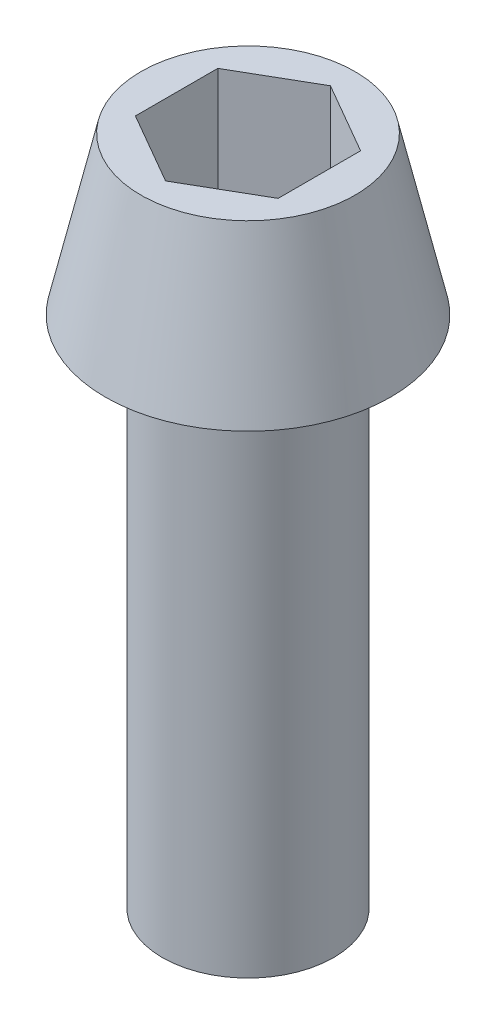
ISO-10303-21;
HEADER;
FILE_DESCRIPTION(('STEP AP214'),'2;1');
FILE_NAME('part.step','',(''),(''),'','','');
FILE_SCHEMA(('AUTOMOTIVE_DESIGN { 1 0 10303 214 1 1 1 1 }'));
ENDSEC;
DATA;
#1=APPLICATION_CONTEXT('core data for automotive mechanical design processes');
#2=APPLICATION_PROTOCOL_DEFINITION('international standard','automotive_design',2000,#1);
#3=PRODUCT_CONTEXT('',#1,'mechanical');
#4=PRODUCT('Part','Part','',(#3));
#5=PRODUCT_RELATED_PRODUCT_CATEGORY('part','',(#4));
#6=PRODUCT_DEFINITION_FORMATION('','',#4);
#7=PRODUCT_DEFINITION_CONTEXT('part definition',#1,'design');
#8=PRODUCT_DEFINITION('design','',#6,#7);
#9=PRODUCT_DEFINITION_SHAPE('','',#8);
#10=(LENGTH_UNIT() NAMED_UNIT(*) SI_UNIT(.MILLI.,.METRE.));
#11=(NAMED_UNIT(*) PLANE_ANGLE_UNIT() SI_UNIT($,.RADIAN.));
#12=(NAMED_UNIT(*) SI_UNIT($,.STERADIAN.) SOLID_ANGLE_UNIT());
#13=UNCERTAINTY_MEASURE_WITH_UNIT(LENGTH_MEASURE(1.E-05),#10,'distance_accuracy_value','');
#14=(GEOMETRIC_REPRESENTATION_CONTEXT(3) GLOBAL_UNCERTAINTY_ASSIGNED_CONTEXT((#13)) GLOBAL_UNIT_ASSIGNED_CONTEXT((#10,
#11,#12)) REPRESENTATION_CONTEXT('',''));
#15=CARTESIAN_POINT('',(0.,0.,0.));
#16=DIRECTION('',(0.,0.,1.));
#17=DIRECTION('',(1.,0.,0.));
#18=AXIS2_PLACEMENT_3D('',#15,#16,#17);
#19=CARTESIAN_POINT('',(0.,5.5,0.));
#20=DIRECTION('',(0.,1.,0.));
#21=DIRECTION('',(-1.,0.,0.));
#22=AXIS2_PLACEMENT_3D('',#19,#20,#21);
#23=PLANE('',#22);
#24=DIRECTION('',(-0.866025403784439,0.,-0.5));
#25=VECTOR('',#24,1.);
#26=CARTESIAN_POINT('',(2.5,5.5,-1.44337567297406));
#27=LINE('',#26,#25);
#28=CARTESIAN_POINT('',(2.5,5.5,-1.44337567297406));
#29=VERTEX_POINT('',#28);
#30=CARTESIAN_POINT('',(0.,5.5,-2.88675134594813));
#31=VERTEX_POINT('',#30);
#32=EDGE_CURVE('E41',#29,#31,#27,.T.);
#33=ORIENTED_EDGE('',*,*,#32,.F.);
#34=DIRECTION('',(0.,0.,-1.));
#35=VECTOR('',#34,1.);
#36=CARTESIAN_POINT('',(2.5,5.5,1.44337567297407));
#37=LINE('',#36,#35);
#38=CARTESIAN_POINT('',(2.5,5.5,1.44337567297407));
#39=VERTEX_POINT('',#38);
#40=EDGE_CURVE('E110',#39,#29,#37,.T.);
#41=ORIENTED_EDGE('',*,*,#40,.F.);
#42=DIRECTION('',(0.866025403784439,0.,-0.5));
#43=VECTOR('',#42,1.);
#44=CARTESIAN_POINT('',(0.,5.5,2.88675134594813));
#45=LINE('',#44,#43);
#46=CARTESIAN_POINT('',(0.,5.5,2.88675134594813));
#47=VERTEX_POINT('',#46);
#48=EDGE_CURVE('E104',#47,#39,#45,.T.);
#49=ORIENTED_EDGE('',*,*,#48,.F.);
#50=DIRECTION('',(0.866025403784439,0.,0.5));
#51=VECTOR('',#50,1.);
#52=CARTESIAN_POINT('',(-2.5,5.5,1.44337567297406));
#53=LINE('',#52,#51);
#54=CARTESIAN_POINT('',(-2.5,5.5,1.44337567297406));
#55=VERTEX_POINT('',#54);
#56=EDGE_CURVE('E102',#55,#47,#53,.T.);
#57=ORIENTED_EDGE('',*,*,#56,.F.);
#58=DIRECTION('',(0.,0.,1.));
#59=VECTOR('',#58,1.);
#60=CARTESIAN_POINT('',(-2.5,5.5,-1.44337567297407));
#61=LINE('',#60,#59);
#62=CARTESIAN_POINT('',(-2.5,5.5,-1.44337567297407));
#63=VERTEX_POINT('',#62);
#64=EDGE_CURVE('E84',#63,#55,#61,.T.);
#65=ORIENTED_EDGE('',*,*,#64,.F.);
#66=DIRECTION('',(-0.866025403784439,0.,0.5));
#67=VECTOR('',#66,1.);
#68=CARTESIAN_POINT('',(0.,5.5,-2.88675134594813));
#69=LINE('',#68,#67);
#70=EDGE_CURVE('E95',#31,#63,#69,.T.);
#71=ORIENTED_EDGE('',*,*,#70,.F.);
#72=EDGE_LOOP('',(#33,#41,#49,#57,#65,#71));
#73=FACE_BOUND('',#72,.T.);
#74=CARTESIAN_POINT('',(0.,5.5,0.));
#75=DIRECTION('',(0.,1.,0.));
#76=DIRECTION('',(-1.,0.,0.));
#77=AXIS2_PLACEMENT_3D('',#74,#75,#76);
#78=CIRCLE('',#77,3.74999999999999);
#79=CARTESIAN_POINT('',(-3.74999999999999,5.5,0.));
#80=VERTEX_POINT('',#79);
#81=EDGE_CURVE('E128',#80,#80,#78,.T.);
#82=ORIENTED_EDGE('',*,*,#81,.T.);
#83=EDGE_LOOP('',(#82));
#84=FACE_BOUND('',#83,.T.);
#85=ADVANCED_FACE('F27',(#73,#84),#23,.T.);
#86=CARTESIAN_POINT('',(-3.,-18.,0.));
#87=DIRECTION('',(0.,-1.,0.));
#88=DIRECTION('',(1.,0.,0.));
#89=AXIS2_PLACEMENT_3D('',#86,#87,#88);
#90=PLANE('',#89);
#91=CARTESIAN_POINT('',(0.,-18.,0.));
#92=DIRECTION('',(0.,1.,0.));
#93=DIRECTION('',(-1.,0.,0.));
#94=AXIS2_PLACEMENT_3D('',#91,#92,#93);
#95=CIRCLE('',#94,3.);
#96=CARTESIAN_POINT('',(-3.,-18.,0.));
#97=VERTEX_POINT('',#96);
#98=EDGE_CURVE('E11',#97,#97,#95,.T.);
#99=ORIENTED_EDGE('',*,*,#98,.F.);
#100=EDGE_LOOP('',(#99));
#101=FACE_BOUND('',#100,.T.);
#102=ADVANCED_FACE('F147',(#101),#90,.T.);
#103=CARTESIAN_POINT('',(0.,21.1330687830688,0.));
#104=DIRECTION('',(0.,1.,0.));
#105=DIRECTION('',(-1.,0.,0.));
#106=AXIS2_PLACEMENT_3D('',#103,#104,#105);
#107=CYLINDRICAL_SURFACE('',#106,3.);
#108=ORIENTED_EDGE('',*,*,#98,.T.);
#109=EDGE_LOOP('',(#108));
#110=FACE_BOUND('',#109,.T.);
#111=CARTESIAN_POINT('',(0.,0.,0.));
#112=DIRECTION('',(0.,1.,0.));
#113=DIRECTION('',(-1.,0.,0.));
#114=AXIS2_PLACEMENT_3D('',#111,#112,#113);
#115=CIRCLE('',#114,2.99999999999999);
#116=CARTESIAN_POINT('',(-2.99999999999999,0.,0.));
#117=VERTEX_POINT('',#116);
#118=EDGE_CURVE('E34',#117,#117,#115,.T.);
#119=ORIENTED_EDGE('',*,*,#118,.F.);
#120=EDGE_LOOP('',(#119));
#121=FACE_BOUND('',#120,.T.);
#122=ADVANCED_FACE('F145',(#110,#121),#107,.T.);
#123=CARTESIAN_POINT('',(-4.99999999999999,0.,0.));
#124=DIRECTION('',(0.,-1.,0.));
#125=DIRECTION('',(1.,0.,0.));
#126=AXIS2_PLACEMENT_3D('',#123,#124,#125);
#127=PLANE('',#126);
#128=ORIENTED_EDGE('',*,*,#118,.T.);
#129=EDGE_LOOP('',(#128));
#130=FACE_BOUND('',#129,.T.);
#131=CARTESIAN_POINT('',(0.,0.,0.));
#132=DIRECTION('',(0.,1.,0.));
#133=DIRECTION('',(-1.,0.,0.));
#134=AXIS2_PLACEMENT_3D('',#131,#132,#133);
#135=CIRCLE('',#134,4.99999999999999);
#136=CARTESIAN_POINT('',(-4.99999999999999,0.,0.));
#137=VERTEX_POINT('',#136);
#138=EDGE_CURVE('E137',#137,#137,#135,.T.);
#139=ORIENTED_EDGE('',*,*,#138,.F.);
#140=EDGE_LOOP('',(#139));
#141=FACE_BOUND('',#140,.T.);
#142=ADVANCED_FACE('F142',(#130,#141),#127,.T.);
#143=CARTESIAN_POINT('',(0.,5.5,0.));
#144=DIRECTION('',(0.,-1.,0.));
#145=DIRECTION('',(1.,0.,0.));
#146=AXIS2_PLACEMENT_3D('',#143,#144,#145);
#147=CONICAL_SURFACE('',#146,3.74999999999999,0.223476601140633);
#148=ORIENTED_EDGE('',*,*,#138,.T.);
#149=EDGE_LOOP('',(#148));
#150=FACE_BOUND('',#149,.T.);
#151=ORIENTED_EDGE('',*,*,#81,.F.);
#152=EDGE_LOOP('',(#151));
#153=FACE_BOUND('',#152,.T.);
#154=ADVANCED_FACE('F154',(#150,#153),#147,.T.);
#155=CARTESIAN_POINT('',(2.5,1.5,-1.44337567297406));
#156=DIRECTION('',(0.5,0.,-0.866025403784439));
#157=DIRECTION('',(-0.866025403784439,0.,-0.5));
#158=AXIS2_PLACEMENT_3D('',#155,#156,#157);
#159=PLANE('',#158);
#160=ORIENTED_EDGE('',*,*,#32,.T.);
#161=DIRECTION('',(0.,1.,0.));
#162=VECTOR('',#161,1.);
#163=CARTESIAN_POINT('',(0.,1.5,-2.88675134594813));
#164=LINE('',#163,#162);
#165=CARTESIAN_POINT('',(0.,1.5,-2.88675134594813));
#166=VERTEX_POINT('',#165);
#167=EDGE_CURVE('E92',#166,#31,#164,.T.);
#168=ORIENTED_EDGE('',*,*,#167,.F.);
#169=DIRECTION('',(-0.866025403784439,0.,-0.5));
#170=VECTOR('',#169,1.);
#171=CARTESIAN_POINT('',(2.5,1.5,-1.44337567297406));
#172=LINE('',#171,#170);
#173=CARTESIAN_POINT('',(2.5,1.5,-1.44337567297406));
#174=VERTEX_POINT('',#173);
#175=EDGE_CURVE('E112',#174,#166,#172,.T.);
#176=ORIENTED_EDGE('',*,*,#175,.F.);
#177=DIRECTION('',(0.,1.,0.));
#178=VECTOR('',#177,1.);
#179=CARTESIAN_POINT('',(2.5,1.5,-1.44337567297406));
#180=LINE('',#179,#178);
#181=EDGE_CURVE('E48',#174,#29,#180,.T.);
#182=ORIENTED_EDGE('',*,*,#181,.T.);
#183=EDGE_LOOP('',(#160,#168,#176,#182));
#184=FACE_BOUND('',#183,.T.);
#185=ADVANCED_FACE('F167',(#184),#159,.F.);
#186=CARTESIAN_POINT('',(2.5,1.5,1.44337567297407));
#187=DIRECTION('',(1.,0.,0.));
#188=DIRECTION('',(0.,0.,-1.));
#189=AXIS2_PLACEMENT_3D('',#186,#187,#188);
#190=PLANE('',#189);
#191=ORIENTED_EDGE('',*,*,#40,.T.);
#192=ORIENTED_EDGE('',*,*,#181,.F.);
#193=DIRECTION('',(0.,0.,-1.));
#194=VECTOR('',#193,1.);
#195=CARTESIAN_POINT('',(2.5,1.5,1.44337567297407));
#196=LINE('',#195,#194);
#197=CARTESIAN_POINT('',(2.5,1.5,1.44337567297407));
#198=VERTEX_POINT('',#197);
#199=EDGE_CURVE('E124',#198,#174,#196,.T.);
#200=ORIENTED_EDGE('',*,*,#199,.F.);
#201=DIRECTION('',(0.,1.,0.));
#202=VECTOR('',#201,1.);
#203=CARTESIAN_POINT('',(2.5,1.5,1.44337567297407));
#204=LINE('',#203,#202);
#205=EDGE_CURVE('E129',#198,#39,#204,.T.);
#206=ORIENTED_EDGE('',*,*,#205,.T.);
#207=EDGE_LOOP('',(#191,#192,#200,#206));
#208=FACE_BOUND('',#207,.T.);
#209=ADVANCED_FACE('F171',(#208),#190,.F.);
#210=CARTESIAN_POINT('',(0.,1.5,2.88675134594813));
#211=DIRECTION('',(0.5,0.,0.866025403784439));
#212=DIRECTION('',(0.866025403784439,0.,-0.5));
#213=AXIS2_PLACEMENT_3D('',#210,#211,#212);
#214=PLANE('',#213);
#215=ORIENTED_EDGE('',*,*,#48,.T.);
#216=ORIENTED_EDGE('',*,*,#205,.F.);
#217=DIRECTION('',(0.866025403784439,0.,-0.5));
#218=VECTOR('',#217,1.);
#219=CARTESIAN_POINT('',(0.,1.5,2.88675134594813));
#220=LINE('',#219,#218);
#221=CARTESIAN_POINT('',(0.,1.5,2.88675134594813));
#222=VERTEX_POINT('',#221);
#223=EDGE_CURVE('E121',#222,#198,#220,.T.);
#224=ORIENTED_EDGE('',*,*,#223,.F.);
#225=DIRECTION('',(0.,1.,0.));
#226=VECTOR('',#225,1.);
#227=CARTESIAN_POINT('',(0.,1.5,2.88675134594813));
#228=LINE('',#227,#226);
#229=EDGE_CURVE('E131',#222,#47,#228,.T.);
#230=ORIENTED_EDGE('',*,*,#229,.T.);
#231=EDGE_LOOP('',(#215,#216,#224,#230));
#232=FACE_BOUND('',#231,.T.);
#233=ADVANCED_FACE('F178',(#232),#214,.F.);
#234=CARTESIAN_POINT('',(-2.5,1.5,1.44337567297406));
#235=DIRECTION('',(-0.5,0.,0.866025403784439));
#236=DIRECTION('',(0.866025403784439,0.,0.5));
#237=AXIS2_PLACEMENT_3D('',#234,#235,#236);
#238=PLANE('',#237);
#239=ORIENTED_EDGE('',*,*,#56,.T.);
#240=ORIENTED_EDGE('',*,*,#229,.F.);
#241=DIRECTION('',(0.866025403784439,0.,0.5));
#242=VECTOR('',#241,1.);
#243=CARTESIAN_POINT('',(-2.5,1.5,1.44337567297406));
#244=LINE('',#243,#242);
#245=CARTESIAN_POINT('',(-2.5,1.5,1.44337567297406));
#246=VERTEX_POINT('',#245);
#247=EDGE_CURVE('E118',#246,#222,#244,.T.);
#248=ORIENTED_EDGE('',*,*,#247,.F.);
#249=DIRECTION('',(0.,1.,0.));
#250=VECTOR('',#249,1.);
#251=CARTESIAN_POINT('',(-2.5,1.5,1.44337567297406));
#252=LINE('',#251,#250);
#253=EDGE_CURVE('E91',#246,#55,#252,.T.);
#254=ORIENTED_EDGE('',*,*,#253,.T.);
#255=EDGE_LOOP('',(#239,#240,#248,#254));
#256=FACE_BOUND('',#255,.T.);
#257=ADVANCED_FACE('F185',(#256),#238,.F.);
#258=CARTESIAN_POINT('',(-2.5,1.5,-1.44337567297407));
#259=DIRECTION('',(-1.,0.,0.));
#260=DIRECTION('',(0.,0.,1.));
#261=AXIS2_PLACEMENT_3D('',#258,#259,#260);
#262=PLANE('',#261);
#263=ORIENTED_EDGE('',*,*,#64,.T.);
#264=ORIENTED_EDGE('',*,*,#253,.F.);
#265=DIRECTION('',(0.,0.,1.));
#266=VECTOR('',#265,1.);
#267=CARTESIAN_POINT('',(-2.5,1.5,-1.44337567297407));
#268=LINE('',#267,#266);
#269=CARTESIAN_POINT('',(-2.5,1.5,-1.44337567297407));
#270=VERTEX_POINT('',#269);
#271=EDGE_CURVE('E87',#270,#246,#268,.T.);
#272=ORIENTED_EDGE('',*,*,#271,.F.);
#273=DIRECTION('',(0.,1.,0.));
#274=VECTOR('',#273,1.);
#275=CARTESIAN_POINT('',(-2.5,1.5,-1.44337567297407));
#276=LINE('',#275,#274);
#277=EDGE_CURVE('E80',#270,#63,#276,.T.);
#278=ORIENTED_EDGE('',*,*,#277,.T.);
#279=EDGE_LOOP('',(#263,#264,#272,#278));
#280=FACE_BOUND('',#279,.T.);
#281=ADVANCED_FACE('F82',(#280),#262,.F.);
#282=CARTESIAN_POINT('',(0.,1.5,-2.88675134594813));
#283=DIRECTION('',(-0.5,0.,-0.866025403784439));
#284=DIRECTION('',(-0.866025403784439,0.,0.5));
#285=AXIS2_PLACEMENT_3D('',#282,#283,#284);
#286=PLANE('',#285);
#287=ORIENTED_EDGE('',*,*,#70,.T.);
#288=ORIENTED_EDGE('',*,*,#277,.F.);
#289=DIRECTION('',(-0.866025403784439,0.,0.5));
#290=VECTOR('',#289,1.);
#291=CARTESIAN_POINT('',(0.,1.5,-2.88675134594813));
#292=LINE('',#291,#290);
#293=EDGE_CURVE('E115',#166,#270,#292,.T.);
#294=ORIENTED_EDGE('',*,*,#293,.F.);
#295=ORIENTED_EDGE('',*,*,#167,.T.);
#296=EDGE_LOOP('',(#287,#288,#294,#295));
#297=FACE_BOUND('',#296,.T.);
#298=ADVANCED_FACE('F96',(#297),#286,.F.);
#299=CARTESIAN_POINT('',(0.,1.5,-2.88675134594813));
#300=DIRECTION('',(0.,1.,0.));
#301=DIRECTION('',(0.,0.,1.));
#302=AXIS2_PLACEMENT_3D('',#299,#300,#301);
#303=PLANE('',#302);
#304=ORIENTED_EDGE('',*,*,#175,.T.);
#305=ORIENTED_EDGE('',*,*,#293,.T.);
#306=ORIENTED_EDGE('',*,*,#271,.T.);
#307=ORIENTED_EDGE('',*,*,#247,.T.);
#308=ORIENTED_EDGE('',*,*,#223,.T.);
#309=ORIENTED_EDGE('',*,*,#199,.T.);
#310=EDGE_LOOP('',(#304,#305,#306,#307,#308,#309));
#311=FACE_BOUND('',#310,.T.);
#312=ADVANCED_FACE('F206',(#311),#303,.T.);
#313=CLOSED_SHELL('',(#85,#102,#122,#142,#154,#185,#209,#233,#257,#281,#298,#312));
#314=MANIFOLD_SOLID_BREP('B2',#313);
#315=ADVANCED_BREP_SHAPE_REPRESENTATION('',(#18,#314),#14);
#316=SHAPE_DEFINITION_REPRESENTATION(#9,#315);
ENDSEC;
END-ISO-10303-21;
